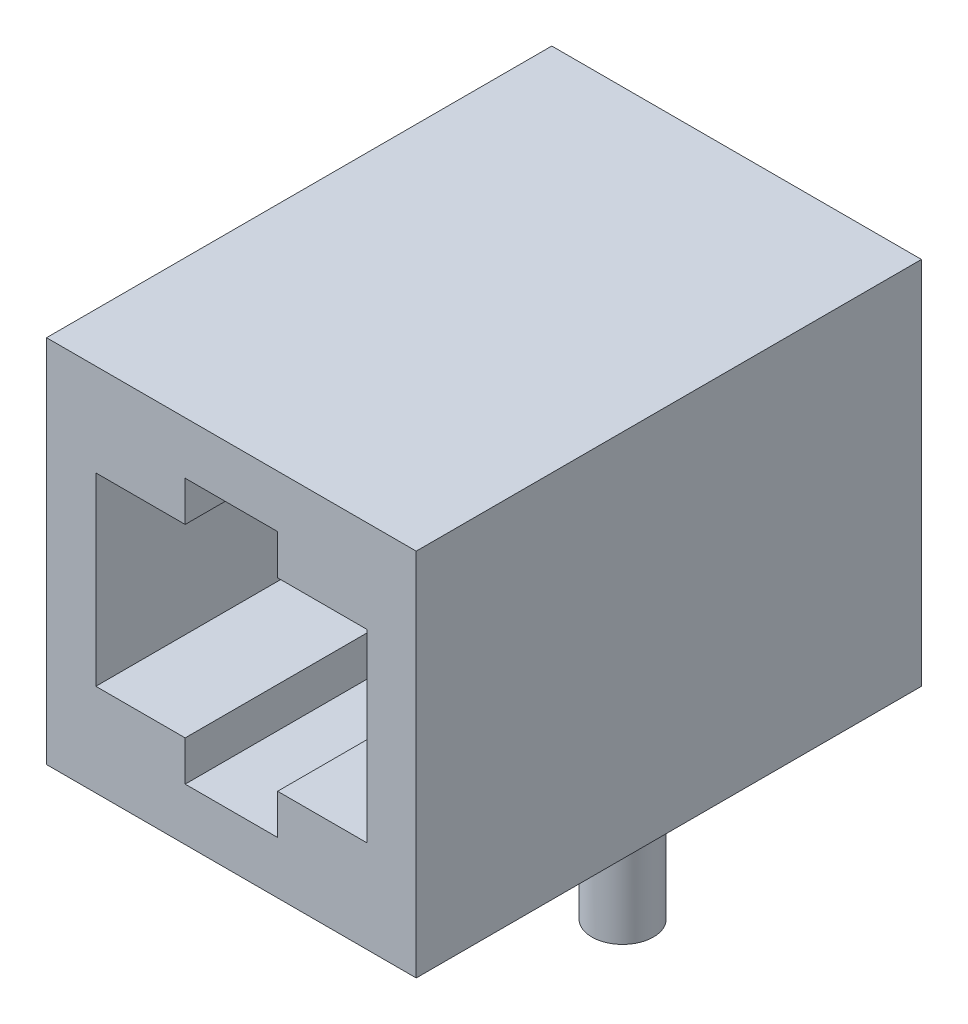
ISO-10303-21;
HEADER;
FILE_DESCRIPTION(('STEP AP214'),'2;1');
FILE_NAME('part.step','',(''),(''),'','','');
FILE_SCHEMA(('AUTOMOTIVE_DESIGN { 1 0 10303 214 1 1 1 1 }'));
ENDSEC;
DATA;
#1=APPLICATION_CONTEXT('core data for automotive mechanical design processes');
#2=APPLICATION_PROTOCOL_DEFINITION('international standard','automotive_design',2000,#1);
#3=PRODUCT_CONTEXT('',#1,'mechanical');
#4=PRODUCT('Part','Part','',(#3));
#5=PRODUCT_RELATED_PRODUCT_CATEGORY('part','',(#4));
#6=PRODUCT_DEFINITION_FORMATION('','',#4);
#7=PRODUCT_DEFINITION_CONTEXT('part definition',#1,'design');
#8=PRODUCT_DEFINITION('design','',#6,#7);
#9=PRODUCT_DEFINITION_SHAPE('','',#8);
#10=(LENGTH_UNIT() NAMED_UNIT(*) SI_UNIT(.MILLI.,.METRE.));
#11=(NAMED_UNIT(*) PLANE_ANGLE_UNIT() SI_UNIT($,.RADIAN.));
#12=(NAMED_UNIT(*) SI_UNIT($,.STERADIAN.) SOLID_ANGLE_UNIT());
#13=UNCERTAINTY_MEASURE_WITH_UNIT(LENGTH_MEASURE(1.E-05),#10,'distance_accuracy_value','');
#14=(GEOMETRIC_REPRESENTATION_CONTEXT(3) GLOBAL_UNCERTAINTY_ASSIGNED_CONTEXT((#13)) GLOBAL_UNIT_ASSIGNED_CONTEXT((#10,
#11,#12)) REPRESENTATION_CONTEXT('',''));
#15=CARTESIAN_POINT('',(0.,0.,0.));
#16=DIRECTION('',(0.,0.,1.));
#17=DIRECTION('',(1.,0.,0.));
#18=AXIS2_PLACEMENT_3D('',#15,#16,#17);
#19=CARTESIAN_POINT('',(-7.62,-7.62,20.828));
#20=DIRECTION('',(1.,0.,0.));
#21=DIRECTION('',(0.,0.,-1.));
#22=AXIS2_PLACEMENT_3D('',#19,#20,#21);
#23=PLANE('',#22);
#24=DIRECTION('',(0.,-1.,0.));
#25=VECTOR('',#24,1.);
#26=CARTESIAN_POINT('',(-7.62,-7.62,0.));
#27=LINE('',#26,#25);
#28=CARTESIAN_POINT('',(-7.62,7.62,0.));
#29=VERTEX_POINT('',#28);
#30=CARTESIAN_POINT('',(-7.62,-7.62,0.));
#31=VERTEX_POINT('',#30);
#32=EDGE_CURVE('E243',#29,#31,#27,.T.);
#33=ORIENTED_EDGE('',*,*,#32,.T.);
#34=DIRECTION('',(0.,0.,-1.));
#35=VECTOR('',#34,1.);
#36=CARTESIAN_POINT('',(-7.62,-7.62,20.828));
#37=LINE('',#36,#35);
#38=CARTESIAN_POINT('',(-7.62,-7.62,20.828));
#39=VERTEX_POINT('',#38);
#40=EDGE_CURVE('E283',#39,#31,#37,.T.);
#41=ORIENTED_EDGE('',*,*,#40,.F.);
#42=DIRECTION('',(0.,-1.,0.));
#43=VECTOR('',#42,1.);
#44=CARTESIAN_POINT('',(-7.62,-7.62,20.828));
#45=LINE('',#44,#43);
#46=CARTESIAN_POINT('',(-7.62,7.62,20.828));
#47=VERTEX_POINT('',#46);
#48=EDGE_CURVE('E263',#47,#39,#45,.T.);
#49=ORIENTED_EDGE('',*,*,#48,.F.);
#50=DIRECTION('',(0.,0.,-1.));
#51=VECTOR('',#50,1.);
#52=CARTESIAN_POINT('',(-7.62,7.62,20.828));
#53=LINE('',#52,#51);
#54=EDGE_CURVE('E269',#47,#29,#53,.T.);
#55=ORIENTED_EDGE('',*,*,#54,.T.);
#56=EDGE_LOOP('',(#33,#41,#49,#55));
#57=FACE_BOUND('',#56,.T.);
#58=ADVANCED_FACE('F35',(#57),#23,.F.);
#59=CARTESIAN_POINT('',(7.62,-7.62,20.828));
#60=DIRECTION('',(0.,1.,0.));
#61=DIRECTION('',(-1.,0.,0.));
#62=AXIS2_PLACEMENT_3D('',#59,#60,#61);
#63=PLANE('',#62);
#64=CARTESIAN_POINT('',(5.715,-7.62,10.414));
#65=DIRECTION('',(0.,1.,0.));
#66=DIRECTION('',(-1.,0.,0.));
#67=AXIS2_PLACEMENT_3D('',#64,#65,#66);
#68=CIRCLE('',#67,1.27);
#69=CARTESIAN_POINT('',(4.445,-7.62,10.414));
#70=VERTEX_POINT('',#69);
#71=EDGE_CURVE('E11',#70,#70,#68,.F.);
#72=ORIENTED_EDGE('',*,*,#71,.F.);
#73=EDGE_LOOP('',(#72));
#74=FACE_BOUND('',#73,.T.);
#75=CARTESIAN_POINT('',(-5.715,-7.62,10.414));
#76=DIRECTION('',(0.,1.,0.));
#77=DIRECTION('',(-1.,0.,0.));
#78=AXIS2_PLACEMENT_3D('',#75,#76,#77);
#79=CIRCLE('',#78,1.27);
#80=CARTESIAN_POINT('',(-6.985,-7.62,10.414));
#81=VERTEX_POINT('',#80);
#82=EDGE_CURVE('E42',#81,#81,#79,.F.);
#83=ORIENTED_EDGE('',*,*,#82,.F.);
#84=EDGE_LOOP('',(#83));
#85=FACE_BOUND('',#84,.T.);
#86=DIRECTION('',(1.,0.,0.));
#87=VECTOR('',#86,1.);
#88=CARTESIAN_POINT('',(7.62,-7.62,0.));
#89=LINE('',#88,#87);
#90=CARTESIAN_POINT('',(7.62,-7.62,0.));
#91=VERTEX_POINT('',#90);
#92=EDGE_CURVE('E272',#31,#91,#89,.T.);
#93=ORIENTED_EDGE('',*,*,#92,.T.);
#94=DIRECTION('',(0.,0.,-1.));
#95=VECTOR('',#94,1.);
#96=CARTESIAN_POINT('',(7.62,-7.62,20.828));
#97=LINE('',#96,#95);
#98=CARTESIAN_POINT('',(7.62,-7.62,20.828));
#99=VERTEX_POINT('',#98);
#100=EDGE_CURVE('E280',#99,#91,#97,.T.);
#101=ORIENTED_EDGE('',*,*,#100,.F.);
#102=DIRECTION('',(1.,0.,0.));
#103=VECTOR('',#102,1.);
#104=CARTESIAN_POINT('',(7.62,-7.62,20.828));
#105=LINE('',#104,#103);
#106=EDGE_CURVE('E87',#39,#99,#105,.T.);
#107=ORIENTED_EDGE('',*,*,#106,.F.);
#108=ORIENTED_EDGE('',*,*,#40,.T.);
#109=EDGE_LOOP('',(#93,#101,#107,#108));
#110=FACE_BOUND('',#109,.T.);
#111=ADVANCED_FACE('F289',(#74,#85,#110),#63,.F.);
#112=CARTESIAN_POINT('',(7.62,-7.62,20.828));
#113=DIRECTION('',(-1.,0.,0.));
#114=DIRECTION('',(0.,0.,1.));
#115=AXIS2_PLACEMENT_3D('',#112,#113,#114);
#116=PLANE('',#115);
#117=DIRECTION('',(0.,1.,0.));
#118=VECTOR('',#117,1.);
#119=CARTESIAN_POINT('',(7.62,-7.62,0.));
#120=LINE('',#119,#118);
#121=CARTESIAN_POINT('',(7.62,7.62,0.));
#122=VERTEX_POINT('',#121);
#123=EDGE_CURVE('E274',#91,#122,#120,.T.);
#124=ORIENTED_EDGE('',*,*,#123,.T.);
#125=DIRECTION('',(0.,0.,-1.));
#126=VECTOR('',#125,1.);
#127=CARTESIAN_POINT('',(7.62,7.62,20.828));
#128=LINE('',#127,#126);
#129=CARTESIAN_POINT('',(7.62,7.62,20.828));
#130=VERTEX_POINT('',#129);
#131=EDGE_CURVE('E278',#130,#122,#128,.T.);
#132=ORIENTED_EDGE('',*,*,#131,.F.);
#133=DIRECTION('',(0.,1.,0.));
#134=VECTOR('',#133,1.);
#135=CARTESIAN_POINT('',(7.62,-7.62,20.828));
#136=LINE('',#135,#134);
#137=EDGE_CURVE('E266',#99,#130,#136,.T.);
#138=ORIENTED_EDGE('',*,*,#137,.F.);
#139=ORIENTED_EDGE('',*,*,#100,.T.);
#140=EDGE_LOOP('',(#124,#132,#138,#139));
#141=FACE_BOUND('',#140,.T.);
#142=ADVANCED_FACE('F291',(#141),#116,.F.);
#143=CARTESIAN_POINT('',(7.62,7.62,20.828));
#144=DIRECTION('',(0.,-1.,0.));
#145=DIRECTION('',(1.,0.,0.));
#146=AXIS2_PLACEMENT_3D('',#143,#144,#145);
#147=PLANE('',#146);
#148=DIRECTION('',(-1.,0.,0.));
#149=VECTOR('',#148,1.);
#150=CARTESIAN_POINT('',(7.62,7.62,0.));
#151=LINE('',#150,#149);
#152=EDGE_CURVE('E79',#122,#29,#151,.T.);
#153=ORIENTED_EDGE('',*,*,#152,.T.);
#154=ORIENTED_EDGE('',*,*,#54,.F.);
#155=DIRECTION('',(-1.,0.,0.));
#156=VECTOR('',#155,1.);
#157=CARTESIAN_POINT('',(7.62,7.62,20.828));
#158=LINE('',#157,#156);
#159=EDGE_CURVE('E58',#130,#47,#158,.T.);
#160=ORIENTED_EDGE('',*,*,#159,.F.);
#161=ORIENTED_EDGE('',*,*,#131,.T.);
#162=EDGE_LOOP('',(#153,#154,#160,#161));
#163=FACE_BOUND('',#162,.T.);
#164=ADVANCED_FACE('F303',(#163),#147,.F.);
#165=CARTESIAN_POINT('',(0.,0.,20.828));
#166=DIRECTION('',(0.,0.,1.));
#167=DIRECTION('',(1.,0.,0.));
#168=AXIS2_PLACEMENT_3D('',#165,#166,#167);
#169=PLANE('',#168);
#170=DIRECTION('',(-1.,0.,0.));
#171=VECTOR('',#170,1.);
#172=CARTESIAN_POINT('',(-1.905,3.81,20.828));
#173=LINE('',#172,#171);
#174=CARTESIAN_POINT('',(-1.905,3.81,20.828));
#175=VERTEX_POINT('',#174);
#176=CARTESIAN_POINT('',(-5.588,3.81,20.828));
#177=VERTEX_POINT('',#176);
#178=EDGE_CURVE('E49',#175,#177,#173,.T.);
#179=ORIENTED_EDGE('',*,*,#178,.F.);
#180=DIRECTION('',(0.,-1.,0.));
#181=VECTOR('',#180,1.);
#182=CARTESIAN_POINT('',(-1.905,3.81,20.828));
#183=LINE('',#182,#181);
#184=CARTESIAN_POINT('',(-1.905,5.461,20.828));
#185=VERTEX_POINT('',#184);
#186=EDGE_CURVE('E178',#185,#175,#183,.T.);
#187=ORIENTED_EDGE('',*,*,#186,.F.);
#188=DIRECTION('',(-1.,0.,0.));
#189=VECTOR('',#188,1.);
#190=CARTESIAN_POINT('',(-1.905,5.461,20.828));
#191=LINE('',#190,#189);
#192=CARTESIAN_POINT('',(1.905,5.461,20.828));
#193=VERTEX_POINT('',#192);
#194=EDGE_CURVE('E181',#193,#185,#191,.T.);
#195=ORIENTED_EDGE('',*,*,#194,.F.);
#196=DIRECTION('',(0.,1.,0.));
#197=VECTOR('',#196,1.);
#198=CARTESIAN_POINT('',(1.905,3.81,20.828));
#199=LINE('',#198,#197);
#200=CARTESIAN_POINT('',(1.905,3.81,20.828));
#201=VERTEX_POINT('',#200);
#202=EDGE_CURVE('E236',#201,#193,#199,.T.);
#203=ORIENTED_EDGE('',*,*,#202,.F.);
#204=DIRECTION('',(-1.,0.,0.));
#205=VECTOR('',#204,1.);
#206=CARTESIAN_POINT('',(5.588,3.81,20.828));
#207=LINE('',#206,#205);
#208=CARTESIAN_POINT('',(5.588,3.81,20.828));
#209=VERTEX_POINT('',#208);
#210=EDGE_CURVE('E233',#209,#201,#207,.T.);
#211=ORIENTED_EDGE('',*,*,#210,.F.);
#212=DIRECTION('',(0.,1.,0.));
#213=VECTOR('',#212,1.);
#214=CARTESIAN_POINT('',(5.588,-3.81,20.828));
#215=LINE('',#214,#213);
#216=CARTESIAN_POINT('',(5.588,-3.81,20.828));
#217=VERTEX_POINT('',#216);
#218=EDGE_CURVE('E230',#217,#209,#215,.T.);
#219=ORIENTED_EDGE('',*,*,#218,.F.);
#220=DIRECTION('',(1.,0.,0.));
#221=VECTOR('',#220,1.);
#222=CARTESIAN_POINT('',(5.588,-3.81,20.828));
#223=LINE('',#222,#221);
#224=CARTESIAN_POINT('',(1.905,-3.81,20.828));
#225=VERTEX_POINT('',#224);
#226=EDGE_CURVE('E227',#225,#217,#223,.T.);
#227=ORIENTED_EDGE('',*,*,#226,.F.);
#228=DIRECTION('',(0.,1.,0.));
#229=VECTOR('',#228,1.);
#230=CARTESIAN_POINT('',(1.905,-3.81,20.828));
#231=LINE('',#230,#229);
#232=CARTESIAN_POINT('',(1.905,-5.461,20.828));
#233=VERTEX_POINT('',#232);
#234=EDGE_CURVE('E224',#233,#225,#231,.T.);
#235=ORIENTED_EDGE('',*,*,#234,.F.);
#236=DIRECTION('',(1.,0.,0.));
#237=VECTOR('',#236,1.);
#238=CARTESIAN_POINT('',(-1.905,-5.461,20.828));
#239=LINE('',#238,#237);
#240=CARTESIAN_POINT('',(-1.905,-5.461,20.828));
#241=VERTEX_POINT('',#240);
#242=EDGE_CURVE('E221',#241,#233,#239,.T.);
#243=ORIENTED_EDGE('',*,*,#242,.F.);
#244=DIRECTION('',(0.,-1.,0.));
#245=VECTOR('',#244,1.);
#246=CARTESIAN_POINT('',(-1.905,-3.81,20.828));
#247=LINE('',#246,#245);
#248=CARTESIAN_POINT('',(-1.905,-3.81,20.828));
#249=VERTEX_POINT('',#248);
#250=EDGE_CURVE('E218',#249,#241,#247,.T.);
#251=ORIENTED_EDGE('',*,*,#250,.F.);
#252=DIRECTION('',(1.,0.,0.));
#253=VECTOR('',#252,1.);
#254=CARTESIAN_POINT('',(-1.905,-3.81,20.828));
#255=LINE('',#254,#253);
#256=CARTESIAN_POINT('',(-5.588,-3.81,20.828));
#257=VERTEX_POINT('',#256);
#258=EDGE_CURVE('E215',#257,#249,#255,.T.);
#259=ORIENTED_EDGE('',*,*,#258,.F.);
#260=DIRECTION('',(0.,-1.,0.));
#261=VECTOR('',#260,1.);
#262=CARTESIAN_POINT('',(-5.588,-3.81,20.828));
#263=LINE('',#262,#261);
#264=EDGE_CURVE('E213',#177,#257,#263,.T.);
#265=ORIENTED_EDGE('',*,*,#264,.F.);
#266=EDGE_LOOP('',(#179,#187,#195,#203,#211,#219,#227,#235,#243,#251,#259,#265));
#267=FACE_BOUND('',#266,.T.);
#268=ORIENTED_EDGE('',*,*,#48,.T.);
#269=ORIENTED_EDGE('',*,*,#106,.T.);
#270=ORIENTED_EDGE('',*,*,#137,.T.);
#271=ORIENTED_EDGE('',*,*,#159,.T.);
#272=EDGE_LOOP('',(#268,#269,#270,#271));
#273=FACE_BOUND('',#272,.T.);
#274=ADVANCED_FACE('F305',(#267,#273),#169,.T.);
#275=CARTESIAN_POINT('',(0.,0.,0.));
#276=DIRECTION('',(0.,0.,1.));
#277=DIRECTION('',(1.,0.,0.));
#278=AXIS2_PLACEMENT_3D('',#275,#276,#277);
#279=PLANE('',#278);
#280=ORIENTED_EDGE('',*,*,#32,.F.);
#281=ORIENTED_EDGE('',*,*,#152,.F.);
#282=ORIENTED_EDGE('',*,*,#123,.F.);
#283=ORIENTED_EDGE('',*,*,#92,.F.);
#284=EDGE_LOOP('',(#280,#281,#282,#283));
#285=FACE_BOUND('',#284,.T.);
#286=ADVANCED_FACE('F300',(#285),#279,.F.);
#287=CARTESIAN_POINT('',(-1.905,3.81,2.54));
#288=DIRECTION('',(0.,1.,0.));
#289=DIRECTION('',(-1.,0.,0.));
#290=AXIS2_PLACEMENT_3D('',#287,#288,#289);
#291=PLANE('',#290);
#292=ORIENTED_EDGE('',*,*,#178,.T.);
#293=DIRECTION('',(0.,0.,1.));
#294=VECTOR('',#293,1.);
#295=CARTESIAN_POINT('',(-5.588,3.81,2.54));
#296=LINE('',#295,#294);
#297=CARTESIAN_POINT('',(-5.588,3.81,2.54));
#298=VERTEX_POINT('',#297);
#299=EDGE_CURVE('E155',#298,#177,#296,.T.);
#300=ORIENTED_EDGE('',*,*,#299,.F.);
#301=DIRECTION('',(-1.,0.,0.));
#302=VECTOR('',#301,1.);
#303=CARTESIAN_POINT('',(-1.905,3.81,2.54));
#304=LINE('',#303,#302);
#305=CARTESIAN_POINT('',(-1.905,3.81,2.54));
#306=VERTEX_POINT('',#305);
#307=EDGE_CURVE('E159',#306,#298,#304,.T.);
#308=ORIENTED_EDGE('',*,*,#307,.F.);
#309=DIRECTION('',(0.,0.,1.));
#310=VECTOR('',#309,1.);
#311=CARTESIAN_POINT('',(-1.905,3.81,2.54));
#312=LINE('',#311,#310);
#313=EDGE_CURVE('E241',#306,#175,#312,.T.);
#314=ORIENTED_EDGE('',*,*,#313,.T.);
#315=EDGE_LOOP('',(#292,#300,#308,#314));
#316=FACE_BOUND('',#315,.T.);
#317=ADVANCED_FACE('F157',(#316),#291,.F.);
#318=CARTESIAN_POINT('',(-1.905,3.81,2.54));
#319=DIRECTION('',(-1.,0.,0.));
#320=DIRECTION('',(0.,0.,1.));
#321=AXIS2_PLACEMENT_3D('',#318,#319,#320);
#322=PLANE('',#321);
#323=ORIENTED_EDGE('',*,*,#186,.T.);
#324=ORIENTED_EDGE('',*,*,#313,.F.);
#325=DIRECTION('',(0.,-1.,0.));
#326=VECTOR('',#325,1.);
#327=CARTESIAN_POINT('',(-1.905,3.81,2.54));
#328=LINE('',#327,#326);
#329=CARTESIAN_POINT('',(-1.905,5.461,2.54));
#330=VERTEX_POINT('',#329);
#331=EDGE_CURVE('E165',#330,#306,#328,.T.);
#332=ORIENTED_EDGE('',*,*,#331,.F.);
#333=DIRECTION('',(0.,0.,1.));
#334=VECTOR('',#333,1.);
#335=CARTESIAN_POINT('',(-1.905,5.461,2.54));
#336=LINE('',#335,#334);
#337=EDGE_CURVE('E244',#330,#185,#336,.T.);
#338=ORIENTED_EDGE('',*,*,#337,.T.);
#339=EDGE_LOOP('',(#323,#324,#332,#338));
#340=FACE_BOUND('',#339,.T.);
#341=ADVANCED_FACE('F354',(#340),#322,.F.);
#342=CARTESIAN_POINT('',(-1.905,5.461,2.54));
#343=DIRECTION('',(0.,1.,0.));
#344=DIRECTION('',(0.,0.,1.));
#345=AXIS2_PLACEMENT_3D('',#342,#343,#344);
#346=PLANE('',#345);
#347=ORIENTED_EDGE('',*,*,#194,.T.);
#348=ORIENTED_EDGE('',*,*,#337,.F.);
#349=DIRECTION('',(-1.,0.,0.));
#350=VECTOR('',#349,1.);
#351=CARTESIAN_POINT('',(-1.905,5.461,2.54));
#352=LINE('',#351,#350);
#353=CARTESIAN_POINT('',(1.905,5.461,2.54));
#354=VERTEX_POINT('',#353);
#355=EDGE_CURVE('E209',#354,#330,#352,.T.);
#356=ORIENTED_EDGE('',*,*,#355,.F.);
#357=DIRECTION('',(0.,0.,1.));
#358=VECTOR('',#357,1.);
#359=CARTESIAN_POINT('',(1.905,5.461,2.54));
#360=LINE('',#359,#358);
#361=EDGE_CURVE('E246',#354,#193,#360,.T.);
#362=ORIENTED_EDGE('',*,*,#361,.T.);
#363=EDGE_LOOP('',(#347,#348,#356,#362));
#364=FACE_BOUND('',#363,.T.);
#365=ADVANCED_FACE('F363',(#364),#346,.F.);
#366=CARTESIAN_POINT('',(1.905,3.81,2.54));
#367=DIRECTION('',(1.,0.,0.));
#368=DIRECTION('',(0.,0.,-1.));
#369=AXIS2_PLACEMENT_3D('',#366,#367,#368);
#370=PLANE('',#369);
#371=ORIENTED_EDGE('',*,*,#202,.T.);
#372=ORIENTED_EDGE('',*,*,#361,.F.);
#373=DIRECTION('',(0.,1.,0.));
#374=VECTOR('',#373,1.);
#375=CARTESIAN_POINT('',(1.905,3.81,2.54));
#376=LINE('',#375,#374);
#377=CARTESIAN_POINT('',(1.905,3.81,2.54));
#378=VERTEX_POINT('',#377);
#379=EDGE_CURVE('E206',#378,#354,#376,.T.);
#380=ORIENTED_EDGE('',*,*,#379,.F.);
#381=DIRECTION('',(0.,0.,1.));
#382=VECTOR('',#381,1.);
#383=CARTESIAN_POINT('',(1.905,3.81,2.54));
#384=LINE('',#383,#382);
#385=EDGE_CURVE('E248',#378,#201,#384,.T.);
#386=ORIENTED_EDGE('',*,*,#385,.T.);
#387=EDGE_LOOP('',(#371,#372,#380,#386));
#388=FACE_BOUND('',#387,.T.);
#389=ADVANCED_FACE('F373',(#388),#370,.F.);
#390=CARTESIAN_POINT('',(5.588,3.81,2.54));
#391=DIRECTION('',(0.,1.,0.));
#392=DIRECTION('',(-1.,0.,0.));
#393=AXIS2_PLACEMENT_3D('',#390,#391,#392);
#394=PLANE('',#393);
#395=ORIENTED_EDGE('',*,*,#210,.T.);
#396=ORIENTED_EDGE('',*,*,#385,.F.);
#397=DIRECTION('',(-1.,0.,0.));
#398=VECTOR('',#397,1.);
#399=CARTESIAN_POINT('',(5.588,3.81,2.54));
#400=LINE('',#399,#398);
#401=CARTESIAN_POINT('',(5.588,3.81,2.54));
#402=VERTEX_POINT('',#401);
#403=EDGE_CURVE('E203',#402,#378,#400,.T.);
#404=ORIENTED_EDGE('',*,*,#403,.F.);
#405=DIRECTION('',(0.,0.,1.));
#406=VECTOR('',#405,1.);
#407=CARTESIAN_POINT('',(5.588,3.81,2.54));
#408=LINE('',#407,#406);
#409=EDGE_CURVE('E250',#402,#209,#408,.T.);
#410=ORIENTED_EDGE('',*,*,#409,.T.);
#411=EDGE_LOOP('',(#395,#396,#404,#410));
#412=FACE_BOUND('',#411,.T.);
#413=ADVANCED_FACE('F383',(#412),#394,.F.);
#414=CARTESIAN_POINT('',(5.588,-3.81,2.54));
#415=DIRECTION('',(1.,0.,0.));
#416=DIRECTION('',(0.,0.,-1.));
#417=AXIS2_PLACEMENT_3D('',#414,#415,#416);
#418=PLANE('',#417);
#419=ORIENTED_EDGE('',*,*,#218,.T.);
#420=ORIENTED_EDGE('',*,*,#409,.F.);
#421=DIRECTION('',(0.,1.,0.));
#422=VECTOR('',#421,1.);
#423=CARTESIAN_POINT('',(5.588,-3.81,2.54));
#424=LINE('',#423,#422);
#425=CARTESIAN_POINT('',(5.588,-3.81,2.54));
#426=VERTEX_POINT('',#425);
#427=EDGE_CURVE('E200',#426,#402,#424,.T.);
#428=ORIENTED_EDGE('',*,*,#427,.F.);
#429=DIRECTION('',(0.,0.,1.));
#430=VECTOR('',#429,1.);
#431=CARTESIAN_POINT('',(5.588,-3.81,2.54));
#432=LINE('',#431,#430);
#433=EDGE_CURVE('E252',#426,#217,#432,.T.);
#434=ORIENTED_EDGE('',*,*,#433,.T.);
#435=EDGE_LOOP('',(#419,#420,#428,#434));
#436=FACE_BOUND('',#435,.T.);
#437=ADVANCED_FACE('F393',(#436),#418,.F.);
#438=CARTESIAN_POINT('',(5.588,-3.81,2.54));
#439=DIRECTION('',(0.,-1.,0.));
#440=DIRECTION('',(1.,0.,0.));
#441=AXIS2_PLACEMENT_3D('',#438,#439,#440);
#442=PLANE('',#441);
#443=ORIENTED_EDGE('',*,*,#226,.T.);
#444=ORIENTED_EDGE('',*,*,#433,.F.);
#445=DIRECTION('',(1.,0.,0.));
#446=VECTOR('',#445,1.);
#447=CARTESIAN_POINT('',(5.588,-3.81,2.54));
#448=LINE('',#447,#446);
#449=CARTESIAN_POINT('',(1.905,-3.81,2.54));
#450=VERTEX_POINT('',#449);
#451=EDGE_CURVE('E197',#450,#426,#448,.T.);
#452=ORIENTED_EDGE('',*,*,#451,.F.);
#453=DIRECTION('',(0.,0.,1.));
#454=VECTOR('',#453,1.);
#455=CARTESIAN_POINT('',(1.905,-3.81,2.54));
#456=LINE('',#455,#454);
#457=EDGE_CURVE('E254',#450,#225,#456,.T.);
#458=ORIENTED_EDGE('',*,*,#457,.T.);
#459=EDGE_LOOP('',(#443,#444,#452,#458));
#460=FACE_BOUND('',#459,.T.);
#461=ADVANCED_FACE('F403',(#460),#442,.F.);
#462=CARTESIAN_POINT('',(1.905,-3.81,2.54));
#463=DIRECTION('',(1.,0.,0.));
#464=DIRECTION('',(0.,1.,0.));
#465=AXIS2_PLACEMENT_3D('',#462,#463,#464);
#466=PLANE('',#465);
#467=ORIENTED_EDGE('',*,*,#234,.T.);
#468=ORIENTED_EDGE('',*,*,#457,.F.);
#469=DIRECTION('',(0.,1.,0.));
#470=VECTOR('',#469,1.);
#471=CARTESIAN_POINT('',(1.905,-3.81,2.54));
#472=LINE('',#471,#470);
#473=CARTESIAN_POINT('',(1.905,-5.461,2.54));
#474=VERTEX_POINT('',#473);
#475=EDGE_CURVE('E194',#474,#450,#472,.T.);
#476=ORIENTED_EDGE('',*,*,#475,.F.);
#477=DIRECTION('',(0.,0.,1.));
#478=VECTOR('',#477,1.);
#479=CARTESIAN_POINT('',(1.905,-5.461,2.54));
#480=LINE('',#479,#478);
#481=EDGE_CURVE('E256',#474,#233,#480,.T.);
#482=ORIENTED_EDGE('',*,*,#481,.T.);
#483=EDGE_LOOP('',(#467,#468,#476,#482));
#484=FACE_BOUND('',#483,.T.);
#485=ADVANCED_FACE('F413',(#484),#466,.F.);
#486=CARTESIAN_POINT('',(-1.905,-5.461,2.54));
#487=DIRECTION('',(0.,-1.,0.));
#488=DIRECTION('',(0.,0.,-1.));
#489=AXIS2_PLACEMENT_3D('',#486,#487,#488);
#490=PLANE('',#489);
#491=ORIENTED_EDGE('',*,*,#242,.T.);
#492=ORIENTED_EDGE('',*,*,#481,.F.);
#493=DIRECTION('',(1.,0.,0.));
#494=VECTOR('',#493,1.);
#495=CARTESIAN_POINT('',(-1.905,-5.461,2.54));
#496=LINE('',#495,#494);
#497=CARTESIAN_POINT('',(-1.905,-5.461,2.54));
#498=VERTEX_POINT('',#497);
#499=EDGE_CURVE('E191',#498,#474,#496,.T.);
#500=ORIENTED_EDGE('',*,*,#499,.F.);
#501=DIRECTION('',(0.,0.,1.));
#502=VECTOR('',#501,1.);
#503=CARTESIAN_POINT('',(-1.905,-5.461,2.54));
#504=LINE('',#503,#502);
#505=EDGE_CURVE('E258',#498,#241,#504,.T.);
#506=ORIENTED_EDGE('',*,*,#505,.T.);
#507=EDGE_LOOP('',(#491,#492,#500,#506));
#508=FACE_BOUND('',#507,.T.);
#509=ADVANCED_FACE('F423',(#508),#490,.F.);
#510=CARTESIAN_POINT('',(-1.905,-3.81,2.54));
#511=DIRECTION('',(-1.,0.,0.));
#512=DIRECTION('',(0.,-1.,0.));
#513=AXIS2_PLACEMENT_3D('',#510,#511,#512);
#514=PLANE('',#513);
#515=ORIENTED_EDGE('',*,*,#250,.T.);
#516=ORIENTED_EDGE('',*,*,#505,.F.);
#517=DIRECTION('',(0.,-1.,0.));
#518=VECTOR('',#517,1.);
#519=CARTESIAN_POINT('',(-1.905,-3.81,2.54));
#520=LINE('',#519,#518);
#521=CARTESIAN_POINT('',(-1.905,-3.81,2.54));
#522=VERTEX_POINT('',#521);
#523=EDGE_CURVE('E188',#522,#498,#520,.T.);
#524=ORIENTED_EDGE('',*,*,#523,.F.);
#525=DIRECTION('',(0.,0.,1.));
#526=VECTOR('',#525,1.);
#527=CARTESIAN_POINT('',(-1.905,-3.81,2.54));
#528=LINE('',#527,#526);
#529=EDGE_CURVE('E260',#522,#249,#528,.T.);
#530=ORIENTED_EDGE('',*,*,#529,.T.);
#531=EDGE_LOOP('',(#515,#516,#524,#530));
#532=FACE_BOUND('',#531,.T.);
#533=ADVANCED_FACE('F433',(#532),#514,.F.);
#534=CARTESIAN_POINT('',(-1.905,-3.81,2.54));
#535=DIRECTION('',(0.,-1.,0.));
#536=DIRECTION('',(1.,0.,0.));
#537=AXIS2_PLACEMENT_3D('',#534,#535,#536);
#538=PLANE('',#537);
#539=ORIENTED_EDGE('',*,*,#258,.T.);
#540=ORIENTED_EDGE('',*,*,#529,.F.);
#541=DIRECTION('',(1.,0.,0.));
#542=VECTOR('',#541,1.);
#543=CARTESIAN_POINT('',(-1.905,-3.81,2.54));
#544=LINE('',#543,#542);
#545=CARTESIAN_POINT('',(-5.588,-3.81,2.54));
#546=VERTEX_POINT('',#545);
#547=EDGE_CURVE('E173',#546,#522,#544,.T.);
#548=ORIENTED_EDGE('',*,*,#547,.F.);
#549=DIRECTION('',(0.,0.,1.));
#550=VECTOR('',#549,1.);
#551=CARTESIAN_POINT('',(-5.588,-3.81,2.54));
#552=LINE('',#551,#550);
#553=EDGE_CURVE('E164',#546,#257,#552,.T.);
#554=ORIENTED_EDGE('',*,*,#553,.T.);
#555=EDGE_LOOP('',(#539,#540,#548,#554));
#556=FACE_BOUND('',#555,.T.);
#557=ADVANCED_FACE('F443',(#556),#538,.F.);
#558=CARTESIAN_POINT('',(-5.588,-3.81,2.54));
#559=DIRECTION('',(-1.,0.,0.));
#560=DIRECTION('',(0.,0.,1.));
#561=AXIS2_PLACEMENT_3D('',#558,#559,#560);
#562=PLANE('',#561);
#563=ORIENTED_EDGE('',*,*,#264,.T.);
#564=ORIENTED_EDGE('',*,*,#553,.F.);
#565=DIRECTION('',(0.,-1.,0.));
#566=VECTOR('',#565,1.);
#567=CARTESIAN_POINT('',(-5.588,-3.81,2.54));
#568=LINE('',#567,#566);
#569=EDGE_CURVE('E168',#298,#546,#568,.T.);
#570=ORIENTED_EDGE('',*,*,#569,.F.);
#571=ORIENTED_EDGE('',*,*,#299,.T.);
#572=EDGE_LOOP('',(#563,#564,#570,#571));
#573=FACE_BOUND('',#572,.T.);
#574=ADVANCED_FACE('F169',(#573),#562,.F.);
#575=CARTESIAN_POINT('',(0.,0.,2.54));
#576=DIRECTION('',(0.,0.,-1.));
#577=DIRECTION('',(-1.,0.,0.));
#578=AXIS2_PLACEMENT_3D('',#575,#576,#577);
#579=PLANE('',#578);
#580=ORIENTED_EDGE('',*,*,#307,.T.);
#581=ORIENTED_EDGE('',*,*,#569,.T.);
#582=ORIENTED_EDGE('',*,*,#547,.T.);
#583=ORIENTED_EDGE('',*,*,#523,.T.);
#584=ORIENTED_EDGE('',*,*,#499,.T.);
#585=ORIENTED_EDGE('',*,*,#475,.T.);
#586=ORIENTED_EDGE('',*,*,#451,.T.);
#587=ORIENTED_EDGE('',*,*,#427,.T.);
#588=ORIENTED_EDGE('',*,*,#403,.T.);
#589=ORIENTED_EDGE('',*,*,#379,.T.);
#590=ORIENTED_EDGE('',*,*,#355,.T.);
#591=ORIENTED_EDGE('',*,*,#331,.T.);
#592=EDGE_LOOP('',(#580,#581,#582,#583,#584,#585,#586,#587,#588,#589,#590,#591));
#593=FACE_BOUND('',#592,.T.);
#594=ADVANCED_FACE('F175',(#593),#579,.F.);
#595=CARTESIAN_POINT('',(-5.715,-11.684,10.414));
#596=DIRECTION('',(0.,1.,0.));
#597=DIRECTION('',(-1.,0.,0.));
#598=AXIS2_PLACEMENT_3D('',#595,#596,#597);
#599=CYLINDRICAL_SURFACE('',#598,1.27);
#600=CARTESIAN_POINT('',(-5.715,-11.684,10.414));
#601=DIRECTION('',(0.,-1.,0.));
#602=DIRECTION('',(1.,0.,0.));
#603=AXIS2_PLACEMENT_3D('',#600,#601,#602);
#604=CIRCLE('',#603,1.27);
#605=CARTESIAN_POINT('',(-4.445,-11.684,10.414));
#606=VERTEX_POINT('',#605);
#607=EDGE_CURVE('E184',#606,#606,#604,.T.);
#608=ORIENTED_EDGE('',*,*,#607,.F.);
#609=EDGE_LOOP('',(#608));
#610=FACE_BOUND('',#609,.T.);
#611=ORIENTED_EDGE('',*,*,#82,.T.);
#612=EDGE_LOOP('',(#611));
#613=FACE_BOUND('',#612,.T.);
#614=ADVANCED_FACE('F287',(#610,#613),#599,.T.);
#615=CARTESIAN_POINT('',(-5.715,-11.684,10.414));
#616=DIRECTION('',(0.,-1.,0.));
#617=DIRECTION('',(1.,0.,0.));
#618=AXIS2_PLACEMENT_3D('',#615,#616,#617);
#619=PLANE('',#618);
#620=ORIENTED_EDGE('',*,*,#607,.T.);
#621=EDGE_LOOP('',(#620));
#622=FACE_BOUND('',#621,.T.);
#623=ADVANCED_FACE('F476',(#622),#619,.T.);
#624=CARTESIAN_POINT('',(5.715,-11.684,10.414));
#625=DIRECTION('',(0.,1.,0.));
#626=DIRECTION('',(-1.,0.,0.));
#627=AXIS2_PLACEMENT_3D('',#624,#625,#626);
#628=CYLINDRICAL_SURFACE('',#627,1.27);
#629=CARTESIAN_POINT('',(5.715,-11.684,10.414));
#630=DIRECTION('',(0.,-1.,0.));
#631=DIRECTION('',(1.,0.,0.));
#632=AXIS2_PLACEMENT_3D('',#629,#630,#631);
#633=CIRCLE('',#632,1.27);
#634=CARTESIAN_POINT('',(6.985,-11.684,10.414));
#635=VERTEX_POINT('',#634);
#636=EDGE_CURVE('E512',#635,#635,#633,.T.);
#637=ORIENTED_EDGE('',*,*,#636,.F.);
#638=EDGE_LOOP('',(#637));
#639=FACE_BOUND('',#638,.T.);
#640=ORIENTED_EDGE('',*,*,#71,.T.);
#641=EDGE_LOOP('',(#640));
#642=FACE_BOUND('',#641,.T.);
#643=ADVANCED_FACE('F483',(#639,#642),#628,.T.);
#644=CARTESIAN_POINT('',(5.715,-11.684,10.414));
#645=DIRECTION('',(0.,-1.,0.));
#646=DIRECTION('',(1.,0.,0.));
#647=AXIS2_PLACEMENT_3D('',#644,#645,#646);
#648=PLANE('',#647);
#649=ORIENTED_EDGE('',*,*,#636,.T.);
#650=EDGE_LOOP('',(#649));
#651=FACE_BOUND('',#650,.T.);
#652=ADVANCED_FACE('F491',(#651),#648,.T.);
#653=CLOSED_SHELL('',(#58,#111,#142,#164,#274,#286,#317,#341,#365,#389,#413,#437,#461,#485,#509,
#533,#557,#574,#594,#614,#623,#643,#652));
#654=MANIFOLD_SOLID_BREP('B2',#653);
#655=ADVANCED_BREP_SHAPE_REPRESENTATION('',(#18,#654),#14);
#656=SHAPE_DEFINITION_REPRESENTATION(#9,#655);
ENDSEC;
END-ISO-10303-21;
